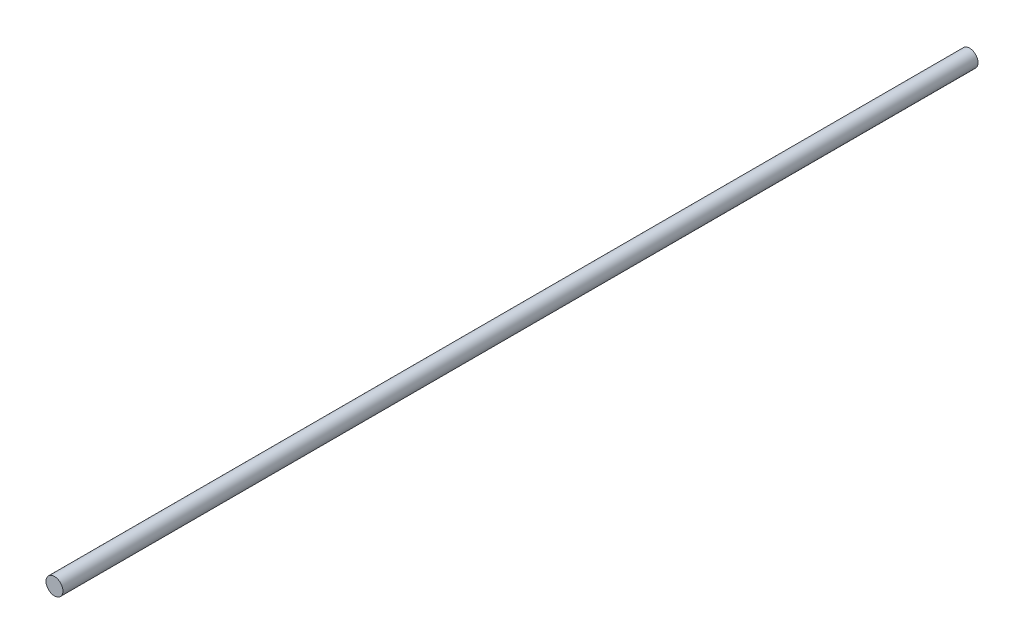
ISO-10303-21;
HEADER;
FILE_DESCRIPTION(('STEP AP214'),'2;1');
FILE_NAME('part.step','',(''),(''),'','','');
FILE_SCHEMA(('AUTOMOTIVE_DESIGN { 1 0 10303 214 1 1 1 1 }'));
ENDSEC;
DATA;
#1=APPLICATION_CONTEXT('core data for automotive mechanical design processes');
#2=APPLICATION_PROTOCOL_DEFINITION('international standard','automotive_design',2000,#1);
#3=PRODUCT_CONTEXT('',#1,'mechanical');
#4=PRODUCT('Part','Part','',(#3));
#5=PRODUCT_RELATED_PRODUCT_CATEGORY('part','',(#4));
#6=PRODUCT_DEFINITION_FORMATION('','',#4);
#7=PRODUCT_DEFINITION_CONTEXT('part definition',#1,'design');
#8=PRODUCT_DEFINITION('design','',#6,#7);
#9=PRODUCT_DEFINITION_SHAPE('','',#8);
#10=(LENGTH_UNIT() NAMED_UNIT(*) SI_UNIT(.MILLI.,.METRE.));
#11=(NAMED_UNIT(*) PLANE_ANGLE_UNIT() SI_UNIT($,.RADIAN.));
#12=(NAMED_UNIT(*) SI_UNIT($,.STERADIAN.) SOLID_ANGLE_UNIT());
#13=UNCERTAINTY_MEASURE_WITH_UNIT(LENGTH_MEASURE(1.E-05),#10,'distance_accuracy_value','');
#14=(GEOMETRIC_REPRESENTATION_CONTEXT(3) GLOBAL_UNCERTAINTY_ASSIGNED_CONTEXT((#13)) GLOBAL_UNIT_ASSIGNED_CONTEXT((#10,
#11,#12)) REPRESENTATION_CONTEXT('',''));
#15=CARTESIAN_POINT('',(0.,0.,0.));
#16=DIRECTION('',(0.,0.,1.));
#17=DIRECTION('',(1.,0.,0.));
#18=AXIS2_PLACEMENT_3D('',#15,#16,#17);
#19=CARTESIAN_POINT('',(0.,0.,500.));
#20=DIRECTION('',(0.,0.,-1.));
#21=DIRECTION('',(-1.,0.,0.));
#22=AXIS2_PLACEMENT_3D('',#19,#20,#21);
#23=PLANE('',#22);
#24=CARTESIAN_POINT('',(0.,0.,500.));
#25=DIRECTION('',(0.,0.,-1.));
#26=DIRECTION('',(-1.,0.,0.));
#27=AXIS2_PLACEMENT_3D('',#24,#25,#26);
#28=CIRCLE('',#27,6.);
#29=CARTESIAN_POINT('',(-6.,0.,500.));
#30=VERTEX_POINT('',#29);
#31=EDGE_CURVE('E18',#30,#30,#28,.T.);
#32=ORIENTED_EDGE('',*,*,#31,.F.);
#33=EDGE_LOOP('',(#32));
#34=FACE_BOUND('',#33,.T.);
#35=ADVANCED_FACE('F15',(#34),#23,.F.);
#36=CARTESIAN_POINT('',(0.,0.,-150.));
#37=DIRECTION('',(0.,0.,-1.));
#38=DIRECTION('',(-1.,0.,0.));
#39=AXIS2_PLACEMENT_3D('',#36,#37,#38);
#40=PLANE('',#39);
#41=CARTESIAN_POINT('',(0.,0.,-150.));
#42=DIRECTION('',(0.,0.,-1.));
#43=DIRECTION('',(-1.,0.,0.));
#44=AXIS2_PLACEMENT_3D('',#41,#42,#43);
#45=CIRCLE('',#44,6.);
#46=CARTESIAN_POINT('',(-6.,0.,-150.));
#47=VERTEX_POINT('',#46);
#48=EDGE_CURVE('E10',#47,#47,#45,.F.);
#49=ORIENTED_EDGE('',*,*,#48,.F.);
#50=EDGE_LOOP('',(#49));
#51=FACE_BOUND('',#50,.T.);
#52=ADVANCED_FACE('F30',(#51),#40,.T.);
#53=CARTESIAN_POINT('',(0.,0.,500.));
#54=DIRECTION('',(0.,0.,-1.));
#55=DIRECTION('',(-1.,0.,0.));
#56=AXIS2_PLACEMENT_3D('',#53,#54,#55);
#57=CYLINDRICAL_SURFACE('',#56,6.);
#58=ORIENTED_EDGE('',*,*,#48,.T.);
#59=EDGE_LOOP('',(#58));
#60=FACE_BOUND('',#59,.T.);
#61=ORIENTED_EDGE('',*,*,#31,.T.);
#62=EDGE_LOOP('',(#61));
#63=FACE_BOUND('',#62,.T.);
#64=ADVANCED_FACE('F27',(#60,#63),#57,.T.);
#65=CLOSED_SHELL('',(#35,#52,#64));
#66=MANIFOLD_SOLID_BREP('B1',#65);
#67=ADVANCED_BREP_SHAPE_REPRESENTATION('',(#18,#66),#14);
#68=SHAPE_DEFINITION_REPRESENTATION(#9,#67);
ENDSEC;
END-ISO-10303-21;
